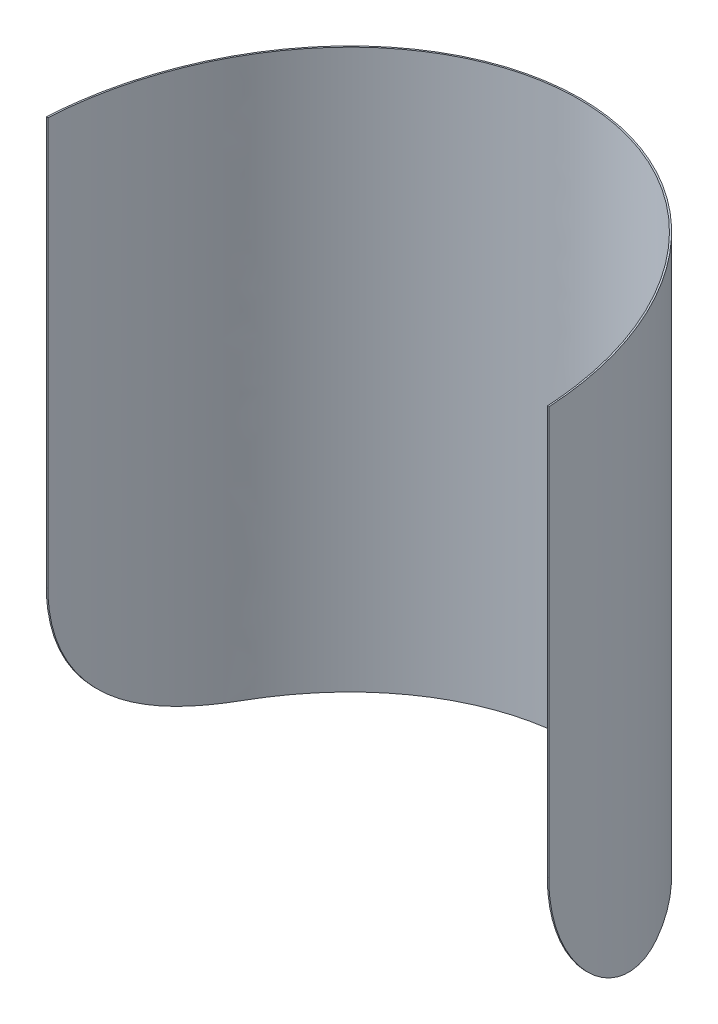
ISO-10303-21;
HEADER;
FILE_DESCRIPTION(('STEP AP214'),'2;1');
FILE_NAME('part.step','',(''),(''),'','','');
FILE_SCHEMA(('AUTOMOTIVE_DESIGN { 1 0 10303 214 1 1 1 1 }'));
ENDSEC;
DATA;
#1=APPLICATION_CONTEXT('core data for automotive mechanical design processes');
#2=APPLICATION_PROTOCOL_DEFINITION('international standard','automotive_design',2000,#1);
#3=PRODUCT_CONTEXT('',#1,'mechanical');
#4=PRODUCT('Part','Part','',(#3));
#5=PRODUCT_RELATED_PRODUCT_CATEGORY('part','',(#4));
#6=PRODUCT_DEFINITION_FORMATION('','',#4);
#7=PRODUCT_DEFINITION_CONTEXT('part definition',#1,'design');
#8=PRODUCT_DEFINITION('design','',#6,#7);
#9=PRODUCT_DEFINITION_SHAPE('','',#8);
#10=(LENGTH_UNIT() NAMED_UNIT(*) SI_UNIT(.MILLI.,.METRE.));
#11=(NAMED_UNIT(*) PLANE_ANGLE_UNIT() SI_UNIT($,.RADIAN.));
#12=(NAMED_UNIT(*) SI_UNIT($,.STERADIAN.) SOLID_ANGLE_UNIT());
#13=UNCERTAINTY_MEASURE_WITH_UNIT(LENGTH_MEASURE(1.E-05),#10,'distance_accuracy_value','');
#14=(GEOMETRIC_REPRESENTATION_CONTEXT(3) GLOBAL_UNCERTAINTY_ASSIGNED_CONTEXT((#13)) GLOBAL_UNIT_ASSIGNED_CONTEXT((#10,
#11,#12)) REPRESENTATION_CONTEXT('',''));
#15=CARTESIAN_POINT('',(0.,0.,0.));
#16=DIRECTION('',(0.,0.,1.));
#17=DIRECTION('',(1.,0.,0.));
#18=AXIS2_PLACEMENT_3D('',#15,#16,#17);
#19=CARTESIAN_POINT('',(-100.,-385.358870368107,-6.6));
#20=DIRECTION('',(0.,0.,-1.));
#21=DIRECTION('',(-1.,0.,0.));
#22=AXIS2_PLACEMENT_3D('',#19,#20,#21);
#23=PLANE('',#22);
#24=DIRECTION('',(1.,0.,0.));
#25=VECTOR('',#24,1.);
#26=CARTESIAN_POINT('',(-83.3199655470095,-135.25,-6.60000000000001));
#27=LINE('',#26,#25);
#28=CARTESIAN_POINT('',(-83.3189655470403,-135.25,-6.59999999999999));
#29=VERTEX_POINT('',#28);
#30=CARTESIAN_POINT('',(-82.8190287071758,-135.25,-6.6));
#31=VERTEX_POINT('',#30);
#32=EDGE_CURVE('E158',#29,#31,#27,.T.);
#33=ORIENTED_EDGE('',*,*,#32,.T.);
#34=DIRECTION('',(0.,1.,0.));
#35=VECTOR('',#34,1.);
#36=CARTESIAN_POINT('',(-82.8190287071758,-185.25,-6.6));
#37=LINE('',#36,#35);
#38=CARTESIAN_POINT('',(-82.8190287071758,0.,-6.6));
#39=VERTEX_POINT('',#38);
#40=EDGE_CURVE('E168',#31,#39,#37,.T.);
#41=ORIENTED_EDGE('',*,*,#40,.T.);
#42=DIRECTION('',(-1.,0.,0.));
#43=VECTOR('',#42,1.);
#44=CARTESIAN_POINT('',(0.,0.,-6.6));
#45=LINE('',#44,#43);
#46=CARTESIAN_POINT('',(-83.3189655470095,0.,-6.6));
#47=VERTEX_POINT('',#46);
#48=EDGE_CURVE('E110',#39,#47,#45,.T.);
#49=ORIENTED_EDGE('',*,*,#48,.T.);
#50=DIRECTION('',(0.,1.,0.));
#51=VECTOR('',#50,1.);
#52=CARTESIAN_POINT('',(-83.3189655470403,-185.25,-6.59999999999999));
#53=LINE('',#52,#51);
#54=EDGE_CURVE('E164',#47,#29,#53,.F.);
#55=ORIENTED_EDGE('',*,*,#54,.T.);
#56=EDGE_LOOP('',(#33,#41,#49,#55));
#57=FACE_BOUND('',#56,.T.);
#58=ADVANCED_FACE('F36',(#57),#23,.F.);
#59=DIRECTION('',(1.,0.,0.));
#60=VECTOR('',#59,1.);
#61=CARTESIAN_POINT('',(-83.3199655470095,-135.25,-6.60000000000001));
#62=LINE('',#61,#60);
#63=CARTESIAN_POINT('',(83.3189655470403,-135.25,-6.60000000000002));
#64=VERTEX_POINT('',#63);
#65=CARTESIAN_POINT('',(82.8190287071757,-135.25,-6.60000000000001));
#66=VERTEX_POINT('',#65);
#67=EDGE_CURVE('E11',#64,#66,#62,.F.);
#68=ORIENTED_EDGE('',*,*,#67,.F.);
#69=DIRECTION('',(0.,1.,0.));
#70=VECTOR('',#69,1.);
#71=CARTESIAN_POINT('',(83.3189655470403,-185.25,-6.60000000000002));
#72=LINE('',#71,#70);
#73=CARTESIAN_POINT('',(83.3189655470095,0.,-6.60000000056195));
#74=VERTEX_POINT('',#73);
#75=EDGE_CURVE('E106',#64,#74,#72,.T.);
#76=ORIENTED_EDGE('',*,*,#75,.T.);
#77=CARTESIAN_POINT('',(82.8190287071757,0.,-6.6));
#78=VERTEX_POINT('',#77);
#79=EDGE_CURVE('E46',#74,#78,#45,.T.);
#80=ORIENTED_EDGE('',*,*,#79,.T.);
#81=DIRECTION('',(0.,1.,0.));
#82=VECTOR('',#81,1.);
#83=CARTESIAN_POINT('',(82.8190287071757,-185.25,-6.6));
#84=LINE('',#83,#82);
#85=EDGE_CURVE('E169',#78,#66,#84,.F.);
#86=ORIENTED_EDGE('',*,*,#85,.T.);
#87=EDGE_LOOP('',(#68,#76,#80,#86));
#88=FACE_BOUND('',#87,.T.);
#89=ADVANCED_FACE('F135',(#88),#23,.F.);
#90=CARTESIAN_POINT('',(0.,-185.25,0.));
#91=DIRECTION('',(0.,-1.,0.));
#92=DIRECTION('',(0.,0.,1.));
#93=AXIS2_PLACEMENT_3D('',#90,#91,#92);
#94=ELLIPSE('',#93,100.,83.);
#95=DIRECTION('',(0.,1.,0.));
#96=VECTOR('',#95,1.);
#97=SURFACE_OF_LINEAR_EXTRUSION('',#94,#96);
#98=CARTESIAN_POINT('',(-68.4256349331156,-185.25,-56.6));
#99=CARTESIAN_POINT('',(-68.7768854216919,-185.250009227083,-55.9836232691039));
#100=CARTESIAN_POINT('',(-69.1217545999552,-185.238602444319,-55.363582897945));
#101=CARTESIAN_POINT('',(-69.7985682322576,-185.192200795737,-54.1169327757958));
#102=CARTESIAN_POINT('',(-70.1305056342758,-185.157193245139,-53.4903196705237));
#103=CARTESIAN_POINT('',(-70.7809961639157,-185.062820603476,-52.2317903809223));
#104=CARTESIAN_POINT('',(-71.0995459299951,-185.003449434686,-51.5998729119282));
#105=CARTESIAN_POINT('',(-71.722886028027,-184.859675828133,-50.3320599066758));
#106=CARTESIAN_POINT('',(-72.0276755823831,-184.775271977796,-49.6961641479086));
#107=CARTESIAN_POINT('',(-72.6236046978122,-184.580704348131,-48.4208671335605));
#108=CARTESIAN_POINT('',(-72.9147256298443,-184.470506571471,-47.7814623486209));
#109=CARTESIAN_POINT('',(-73.4826259240794,-184.223910346305,-46.5014425734839));
#110=CARTESIAN_POINT('',(-73.7594072865977,-184.087515564744,-45.8608277650722));
#111=CARTESIAN_POINT('',(-74.2984793971576,-183.788101872481,-44.5797977107762));
#112=CARTESIAN_POINT('',(-74.5607717269213,-183.62508587565,-43.9393824507279));
#113=CARTESIAN_POINT('',(-75.0707855051028,-183.27210181071,-42.6602001435289));
#114=CARTESIAN_POINT('',(-75.3185070627943,-183.082133944763,-42.0214330840519));
#115=CARTESIAN_POINT('',(-75.8806667504443,-182.60615557447,-40.5315345860122));
#116=CARTESIAN_POINT('',(-76.189339492794,-182.309390133963,-39.6816317216458));
#117=CARTESIAN_POINT('',(-76.7806417910622,-181.666931980979,-37.9912349309126));
#118=CARTESIAN_POINT('',(-77.0632689396481,-181.321234753325,-37.1507418805674));
#119=CARTESIAN_POINT('',(-77.602801528078,-180.581074140397,-35.4830415236626));
#120=CARTESIAN_POINT('',(-77.8597065784688,-180.186610016954,-34.6558344184221));
#121=CARTESIAN_POINT('',(-78.3480134649837,-179.350036294183,-33.0197148414055));
#122=CARTESIAN_POINT('',(-78.5794503791701,-178.907993929941,-32.2107784577222));
#123=CARTESIAN_POINT('',(-79.0180255598844,-177.976689579512,-30.6137666562396));
#124=CARTESIAN_POINT('',(-79.2251642085323,-177.48742833612,-29.8256909105322));
#125=CARTESIAN_POINT('',(-79.6161293305819,-176.462978289869,-28.274130923474));
#126=CARTESIAN_POINT('',(-79.7999572942521,-175.927792426674,-27.5106451124017));
#127=CARTESIAN_POINT('',(-80.2174970669045,-174.580658256523,-25.6993678088911));
#128=CARTESIAN_POINT('',(-80.4401038200078,-173.746266216619,-24.6655814879895));
#129=CARTESIAN_POINT('',(-80.8448379570182,-171.993533458373,-22.6635406915674));
#130=CARTESIAN_POINT('',(-81.0269666307765,-171.075195416323,-21.6952841285972));
#131=CARTESIAN_POINT('',(-81.3552428357818,-169.160164320723,-19.8319902159136));
#132=CARTESIAN_POINT('',(-81.5013716689161,-168.163430902125,-18.9369910761551));
#133=CARTESIAN_POINT('',(-81.7621577830227,-166.098760174588,-17.2280623795057));
#134=CARTESIAN_POINT('',(-81.8768147314995,-165.03082211353,-16.4141336791693));
#135=CARTESIAN_POINT('',(-82.0458472877933,-163.194804694105,-15.1283619922823));
#136=CARTESIAN_POINT('',(-82.1076248704363,-162.444194577532,-14.6323273996913));
#137=CARTESIAN_POINT('',(-82.2205305349098,-160.916680693277,-13.681113796215));
#138=CARTESIAN_POINT('',(-82.2716585476978,-160.139776755165,-13.2259350502144));
#139=CARTESIAN_POINT('',(-82.3645765888824,-158.562094273178,-12.3579726529288));
#140=CARTESIAN_POINT('',(-82.4063664236623,-157.76131523467,-11.9451898807726));
#141=CARTESIAN_POINT('',(-82.4818468234484,-156.138413661754,-11.1633924828316));
#142=CARTESIAN_POINT('',(-82.5155383525234,-155.316293680818,-10.7943726499079));
#143=CARTESIAN_POINT('',(-82.57597726169,-153.653124727272,-10.1012187482144));
#144=CARTESIAN_POINT('',(-82.6027248066798,-152.812076204673,-9.77708361365731));
#145=CARTESIAN_POINT('',(-82.6503156210767,-151.113605625705,-9.17471325128794));
#146=CARTESIAN_POINT('',(-82.6711593926007,-150.256184968415,-8.896474120854));
#147=CARTESIAN_POINT('',(-82.7057300538854,-148.627744023453,-8.41628231231862));
#148=CARTESIAN_POINT('',(-82.7200019603415,-147.858235402592,-8.20922474042236));
#149=CARTESIAN_POINT('',(-82.7451879306554,-146.310203637507,-7.83211638959701));
#150=CARTESIAN_POINT('',(-82.7561022569452,-145.531681202751,-7.66206271870674));
#151=CARTESIAN_POINT('',(-82.775026724812,-143.967394088054,-7.35934929952031));
#152=CARTESIAN_POINT('',(-82.7830369600977,-143.181629642636,-7.22668834467182));
#153=CARTESIAN_POINT('',(-82.796506094786,-141.604961565383,-6.99910637061853));
#154=CARTESIAN_POINT('',(-82.8019660402586,-140.814060175812,-6.90416988009805));
#155=CARTESIAN_POINT('',(-82.8106027937788,-139.228579743979,-6.75218128506744));
#156=CARTESIAN_POINT('',(-82.8137795048411,-138.434000546936,-6.69513078985418));
#157=CARTESIAN_POINT('',(-82.8179832630385,-136.842948029344,-6.61903056231784));
#158=CARTESIAN_POINT('',(-82.8190101187348,-136.046474546435,-6.59998421416804));
#159=CARTESIAN_POINT('',(-82.8190287071758,-135.25,-6.60000000000001));
#160=B_SPLINE_CURVE_WITH_KNOTS('',3,(#98,#99,#100,#101,#102,#103,#104,#105,#106,#107,#108,#109,
#110,#111,#112,#113,#114,#115,#116,#117,#118,#119,#120,#121,#122,#123,#124,#125,#126,#127,#128,
#129,#130,#131,#132,#133,#134,#135,#136,#137,#138,#139,#140,#141,#142,#143,#144,#145,#146,#147,
#148,#149,#150,#151,#152,#153,#154,#155,#156,#157,#158,#159),.UNSPECIFIED.,.F.,.F.,(4,2,2,2,2,2,
2,2,2,2,2,2,2,2,2,2,2,2,2,2,2,2,2,2,2,2,2,2,2,2,4),(0.,2.12820839314464,4.25756155413929,
6.38744622488535,8.51745110620344,10.6502793789544,12.782809324768,14.9151060070412,
17.0473866960945,19.9006932429295,22.7542632502007,25.607876456283,28.457508754264,
31.307096232278,34.1565014422087,38.1924804117551,42.2283307546623,46.2662728967004,
50.3042576973229,53.0084705482084,55.7127009303067,58.4169873763913,61.1209517290926,
63.8248518651448,66.5285219649421,68.9186466695435,71.3085845118898,73.698445229181,
76.0873248180325,78.4763058736808,80.8654996525646),.UNSPECIFIED.);
#161=CARTESIAN_POINT('',(-68.4256349331156,-185.25,-56.6));
#162=VERTEX_POINT('',#161);
#163=EDGE_CURVE('E53',#162,#31,#160,.T.);
#164=ORIENTED_EDGE('',*,*,#163,.F.);
#165=CARTESIAN_POINT('',(68.4256349331155,-185.25,-56.6));
#166=VERTEX_POINT('',#165);
#167=EDGE_CURVE('E111',#162,#166,#94,.T.);
#168=ORIENTED_EDGE('',*,*,#167,.T.);
#169=CARTESIAN_POINT('',(82.8190287071757,-135.25,-6.6));
#170=CARTESIAN_POINT('',(82.8189938383726,-136.182579463709,-6.59997029125117));
#171=CARTESIAN_POINT('',(82.8175951294704,-137.115156734692,-6.62608999415294));
#172=CARTESIAN_POINT('',(82.8118191097757,-138.977362855764,-6.73041384977405));
#173=CARTESIAN_POINT('',(82.8074418679995,-139.906991773668,-6.80861679565888));
#174=CARTESIAN_POINT('',(82.795457931547,-141.760393056435,-7.01689192990505));
#175=CARTESIAN_POINT('',(82.7878512633009,-142.684165469165,-7.14696369376351));
#176=CARTESIAN_POINT('',(82.7689186452344,-144.522667012148,-7.45850426432962));
#177=CARTESIAN_POINT('',(82.7575938597618,-145.437398881236,-7.63995697838318));
#178=CARTESIAN_POINT('',(82.7305638173982,-147.255214010168,-8.05369485365341));
#179=CARTESIAN_POINT('',(82.7148586298198,-148.158297454092,-8.28597921053067));
#180=CARTESIAN_POINT('',(82.6782309790595,-149.949968505322,-8.80063123986303));
#181=CARTESIAN_POINT('',(82.6573085391342,-150.838556177226,-9.08299868906263));
#182=CARTESIAN_POINT('',(82.6092346313272,-152.599007248324,-9.6971044884104));
#183=CARTESIAN_POINT('',(82.5820789755263,-153.470858974414,-10.0288759788361));
#184=CARTESIAN_POINT('',(82.520403461688,-155.194438874739,-10.740555267718));
#185=CARTESIAN_POINT('',(82.4858835069341,-156.046166784522,-11.1204636983368));
#186=CARTESIAN_POINT('',(82.4082095228862,-157.726744108006,-11.9271365394427));
#187=CARTESIAN_POINT('',(82.3650554396986,-158.555593378865,-12.3539012423953));
#188=CARTESIAN_POINT('',(82.2687462962352,-160.187553662371,-13.2527270701272));
#189=CARTESIAN_POINT('',(82.2155931205669,-160.990669491874,-13.7247796509423));
#190=CARTESIAN_POINT('',(82.0978193243822,-162.56870176062,-14.7125922498123));
#191=CARTESIAN_POINT('',(82.0331987597583,-163.343618337286,-15.2283520548299));
#192=CARTESIAN_POINT('',(81.8909786907273,-164.862642442493,-16.3016567194369));
#193=CARTESIAN_POINT('',(81.8133793315694,-165.606750315706,-16.8592011113646));
#194=CARTESIAN_POINT('',(81.6024145107059,-167.415161337367,-18.2945724257203));
#195=CARTESIAN_POINT('',(81.4602670308969,-168.459495440983,-19.19646110309));
#196=CARTESIAN_POINT('',(81.1387844548778,-170.467170910392,-21.0803510069096));
#197=CARTESIAN_POINT('',(80.9594495015556,-171.430512587367,-22.0623519255304));
#198=CARTESIAN_POINT('',(80.6590502016508,-172.809166710907,-23.5881943765757));
#199=CARTESIAN_POINT('',(80.5536987363724,-173.257608790153,-24.1055504745132));
#200=CARTESIAN_POINT('',(80.3319495258846,-174.13177274081,-25.1568001486906));
#201=CARTESIAN_POINT('',(80.2155528348115,-174.557496774343,-25.6906921435052));
#202=CARTESIAN_POINT('',(79.9711747811301,-175.385544563356,-26.7737895576988));
#203=CARTESIAN_POINT('',(79.8431928050157,-175.78786707774,-27.3229957869859));
#204=CARTESIAN_POINT('',(79.575176440381,-176.568431670084,-28.435326353597));
#205=CARTESIAN_POINT('',(79.435142916141,-176.946675471476,-28.9984496907905));
#206=CARTESIAN_POINT('',(79.0991815828628,-177.78711127818,-30.3061944793207));
#207=CARTESIAN_POINT('',(78.8989925208274,-178.24093783526,-31.055120525226));
#208=CARTESIAN_POINT('',(78.4767846288335,-179.106245522915,-32.571028073548));
#209=CARTESIAN_POINT('',(78.2547658859764,-179.517726822436,-33.3380095039136));
#210=CARTESIAN_POINT('',(77.788247619092,-180.29766358959,-34.8868747591911));
#211=CARTESIAN_POINT('',(77.5437479720283,-180.666118821721,-35.6687586656446));
#212=CARTESIAN_POINT('',(77.0315874801619,-181.359877326009,-37.2448660975503));
#213=CARTESIAN_POINT('',(76.7639069455657,-181.685143307397,-38.0390996335811));
#214=CARTESIAN_POINT('',(76.2052960712075,-182.292024368469,-39.6359918753726));
#215=CARTESIAN_POINT('',(75.9143659939315,-182.573639940858,-40.4386504859259));
#216=CARTESIAN_POINT('',(75.3091813434049,-183.093374517334,-42.04914739274));
#217=CARTESIAN_POINT('',(74.9949294791433,-183.331498562181,-42.8569850774869));
#218=CARTESIAN_POINT('',(74.4495868687583,-183.694014054674,-44.2106595887411));
#219=CARTESIAN_POINT('',(74.2248342083543,-183.830157976975,-44.7559436242086));
#220=CARTESIAN_POINT('',(73.764861955969,-184.083149473794,-45.8465447537277));
#221=CARTESIAN_POINT('',(73.5296430306387,-184.199998275092,-46.3918618434708));
#222=CARTESIAN_POINT('',(73.0488255497105,-184.414668089693,-47.4816732928218));
#223=CARTESIAN_POINT('',(72.8032267329822,-184.512488623947,-48.0261676313742));
#224=CARTESIAN_POINT('',(72.3017663642884,-184.689416346468,-49.1135099804492));
#225=CARTESIAN_POINT('',(72.0459041399507,-184.768522306365,-49.6563578805969));
#226=CARTESIAN_POINT('',(71.5246074502643,-184.908228155021,-50.7384803050845));
#227=CARTESIAN_POINT('',(71.2591930569341,-184.968864574803,-51.2777597920462));
#228=CARTESIAN_POINT('',(70.7184948663692,-185.072236511278,-52.3530607985007));
#229=CARTESIAN_POINT('',(70.4432112524356,-185.114972360252,-52.8890823782864));
#230=CARTESIAN_POINT('',(69.8830012694189,-185.182967721967,-53.9570876462278));
#231=CARTESIAN_POINT('',(69.5980761228666,-185.208229441755,-54.489071835923));
#232=CARTESIAN_POINT('',(69.0188503397761,-185.241745445424,-55.5482520812126));
#233=CARTESIAN_POINT('',(68.7245524689809,-185.2500047001,-56.075449491369));
#234=CARTESIAN_POINT('',(68.4256349331156,-185.25,-56.5999999999999));
#235=B_SPLINE_CURVE_WITH_KNOTS('',3,(#169,#170,#171,#172,#173,#174,#175,#176,#177,#178,#179,
#180,#181,#182,#183,#184,#185,#186,#187,#188,#189,#190,#191,#192,#193,#194,#195,#196,#197,#198,
#199,#200,#201,#202,#203,#204,#205,#206,#207,#208,#209,#210,#211,#212,#213,#214,#215,#216,#217,
#218,#219,#220,#221,#222,#223,#224,#225,#226,#227,#228,#229,#230,#231,#232,#233,#234),
.UNSPECIFIED.,.F.,.F.,(4,2,2,2,2,2,2,2,2,2,2,2,2,2,2,2,2,2,2,2,2,2,2,2,2,2,2,2,2,2,2,2,4),(0.,
2.79736863931814,5.59467246232739,8.39195339221513,11.1883591732871,13.9847207083619,
16.7810697784033,19.5793031632203,22.377573299891,25.1758609036871,27.9736216197138,
30.7713686997031,33.569084471403,37.7252998202464,41.8814991996997,43.959103026891,
46.0365087704005,48.114024588679,50.1913915412857,52.8847544366903,55.5781065858789,
58.2714734764623,60.967150977128,63.6627980480745,66.3581324893609,68.1736559371932,
69.9890639099378,71.8045175807157,73.6200903796094,75.4320484711003,77.2439729265205,
79.0556684874577,80.8668343106502),.UNSPECIFIED.);
#236=EDGE_CURVE('E91',#66,#166,#235,.T.);
#237=ORIENTED_EDGE('',*,*,#236,.F.);
#238=ORIENTED_EDGE('',*,*,#85,.F.);
#239=CARTESIAN_POINT('',(0.,0.,0.));
#240=DIRECTION('',(0.,-1.,0.));
#241=DIRECTION('',(0.,0.,1.));
#242=AXIS2_PLACEMENT_3D('',#239,#240,#241);
#243=ELLIPSE('',#242,100.,83.);
#244=EDGE_CURVE('E120',#39,#78,#243,.T.);
#245=ORIENTED_EDGE('',*,*,#244,.F.);
#246=ORIENTED_EDGE('',*,*,#40,.F.);
#247=EDGE_LOOP('',(#164,#168,#237,#238,#245,#246));
#248=FACE_BOUND('',#247,.T.);
#249=ADVANCED_FACE('F38',(#248),#97,.T.);
#250=CARTESIAN_POINT('',(83.5,-185.25,0.));
#251=CARTESIAN_POINT('',(83.5,-185.25,-6.5519432380964));
#252=CARTESIAN_POINT('',(82.4255292073359,-185.25,-19.7256245338788));
#253=CARTESIAN_POINT('',(77.6516490303719,-185.25,-38.6752690979979));
#254=CARTESIAN_POINT('',(69.8969004414113,-185.25,-56.1587176982592));
#255=CARTESIAN_POINT('',(59.456164576806,-185.25,-71.4869891133584));
#256=CARTESIAN_POINT('',(46.7260619809048,-185.25,-84.0734028301062));
#257=CARTESIAN_POINT('',(27.3510641739143,-185.25,-96.5595636040295));
#258=CARTESIAN_POINT('',(0.,-185.25,-103.126957597314));
#259=CARTESIAN_POINT('',(-27.3510641739143,-185.25,-96.5595636040295));
#260=CARTESIAN_POINT('',(-46.7260619809048,-185.25,-84.0734028301062));
#261=CARTESIAN_POINT('',(-59.456164576806,-185.25,-71.4869891133584));
#262=CARTESIAN_POINT('',(-69.8969004414113,-185.25,-56.1587176982592));
#263=CARTESIAN_POINT('',(-77.6516490303719,-185.25,-38.675269097998));
#264=CARTESIAN_POINT('',(-82.4255292073359,-185.25,-19.7256245338788));
#265=CARTESIAN_POINT('',(-83.5,-185.25,-6.55194323809643));
#266=CARTESIAN_POINT('',(-83.5,-185.25,0.));
#267=B_SPLINE_CURVE_WITH_KNOTS('',3,(#250,#251,#252,#253,#254,#255,#256,#257,#258,#259,#260,
#261,#262,#263,#264,#265,#266),.UNSPECIFIED.,.F.,.F.,(4,1,1,1,1,1,1,1,1,1,1,1,1,1,4),
(1.5707963267949,1.76714586764426,1.96349540849362,2.15984494934298,2.35619449019234,
2.55254403104171,2.74889357189107,3.14159265358979,3.53429173528852,3.73064127613788,
3.92699081698724,4.1233403578366,4.31968989868597,4.51603943953533,4.71238898038469),.UNSPECIFIED.);
#268=DIRECTION('',(0.,1.,0.));
#269=VECTOR('',#268,1.);
#270=SURFACE_OF_LINEAR_EXTRUSION('',#267,#269);
#271=CARTESIAN_POINT('',(69.0006883099171,-185.25,-56.6));
#272=CARTESIAN_POINT('',(69.3502812827166,-185.250009602594,-55.9825849151867));
#273=CARTESIAN_POINT('',(69.6934947363422,-185.238564031786,-55.361531330774));
#274=CARTESIAN_POINT('',(70.3670233689338,-185.192013371393,-54.1129217680701));
#275=CARTESIAN_POINT('',(70.6973315624336,-185.156895651035,-53.4853624946339));
#276=CARTESIAN_POINT('',(71.3446170883281,-185.062238127438,-52.2250207913141));
#277=CARTESIAN_POINT('',(71.6615910758855,-185.002692236283,-51.5922370979643));
#278=CARTESIAN_POINT('',(72.2818519038682,-184.8585131878,-50.3227792213991));
#279=CARTESIAN_POINT('',(72.5851379576826,-184.773878590797,-49.6861048169755));
#280=CARTESIAN_POINT('',(73.1781427717037,-184.578801613242,-48.4093390094115));
#281=CARTESIAN_POINT('',(73.4678429665404,-184.468325085837,-47.769244189749));
#282=CARTESIAN_POINT('',(74.0329910063191,-184.221132176329,-46.4879344108603));
#283=CARTESIAN_POINT('',(74.3084408184448,-184.084419428322,-45.8467196189412));
#284=CARTESIAN_POINT('',(74.8449370770198,-183.784338145301,-44.5645759733892));
#285=CARTESIAN_POINT('',(75.1059850893788,-183.620972515932,-43.9236470962153));
#286=CARTESIAN_POINT('',(75.6135890468647,-183.267263743686,-42.6435177043703));
#287=CARTESIAN_POINT('',(75.8601451083814,-183.076920817514,-42.0043171758576));
#288=CARTESIAN_POINT('',(76.4196525299073,-182.600045831103,-40.513503257211));
#289=CARTESIAN_POINT('',(76.7268653471831,-182.302751465028,-39.6631467571867));
#290=CARTESIAN_POINT('',(77.3153178642529,-181.659206888201,-37.9719500262864));
#291=CARTESIAN_POINT('',(77.5965551976567,-181.312952224378,-37.1311106685414));
#292=CARTESIAN_POINT('',(78.1333956289514,-180.571660343035,-35.4628234557515));
#293=CARTESIAN_POINT('',(78.3889983397611,-180.17662238909,-34.6353758030788));
#294=CARTESIAN_POINT('',(78.8748072676395,-179.338897068574,-32.998877223887));
#295=CARTESIAN_POINT('',(79.1050484101104,-178.896276931224,-32.1898022476215));
#296=CARTESIAN_POINT('',(79.5413403495176,-177.963820687264,-30.5926061862542));
#297=CARTESIAN_POINT('',(79.7473915067573,-177.473985284111,-29.8044847891897));
#298=CARTESIAN_POINT('',(80.1362861568883,-176.44839688837,-28.2529168622013));
#299=CARTESIAN_POINT('',(80.3191311151584,-175.912646798692,-27.4894687765276));
#300=CARTESIAN_POINT('',(80.7344615069568,-174.563993888578,-25.6781400604626));
#301=CARTESIAN_POINT('',(80.9558792200671,-173.728635022389,-24.6443140591689));
#302=CARTESIAN_POINT('',(81.3583705665521,-171.97397120931,-22.6423487781005));
#303=CARTESIAN_POINT('',(81.5394455241873,-171.054669019277,-21.6742073429403));
#304=CARTESIAN_POINT('',(81.865696071587,-169.137717510834,-19.811280455709));
#305=CARTESIAN_POINT('',(82.0108529490135,-168.140027709709,-18.9165334016823));
#306=CARTESIAN_POINT('',(82.2698307143882,-166.073468689232,-17.2082411584007));
#307=CARTESIAN_POINT('',(82.383651247106,-165.004598663147,-16.3946968897311));
#308=CARTESIAN_POINT('',(82.5514418415931,-163.167092577912,-15.1096960288548));
#309=CARTESIAN_POINT('',(82.6127623075346,-162.415916886902,-14.6140116892929));
#310=CARTESIAN_POINT('',(82.7248355751405,-160.887292914145,-13.6635470204114));
#311=CARTESIAN_POINT('',(82.7755883119816,-160.109844471273,-13.2087669420109));
#312=CARTESIAN_POINT('',(82.8678315104543,-158.531095022295,-12.3416469512597));
#313=CARTESIAN_POINT('',(82.9093217771424,-157.729793514566,-11.9293079322469));
#314=CARTESIAN_POINT('',(82.9842681169384,-156.105875599218,-11.1484429697595));
#315=CARTESIAN_POINT('',(83.0177251949325,-155.283261871861,-10.779911549228));
#316=CARTESIAN_POINT('',(83.0777492665446,-153.619131212607,-10.0877744681525));
#317=CARTESIAN_POINT('',(83.1043164261194,-152.77761473655,-9.76416772559921));
#318=CARTESIAN_POINT('',(83.1515894232849,-151.078236667715,-9.16289248195904));
#319=CARTESIAN_POINT('',(83.1722957693916,-150.220376499903,-8.88521999623603));
#320=CARTESIAN_POINT('',(83.2065919482044,-148.59334714418,-8.40678007887844));
#321=CARTESIAN_POINT('',(83.2207343843459,-147.825717491539,-8.20079824210056));
#322=CARTESIAN_POINT('',(83.2456990264204,-146.281515946281,-7.82565325101043));
#323=CARTESIAN_POINT('',(83.2565214970975,-145.504944771816,-7.65648716121119));
#324=CARTESIAN_POINT('',(83.2752913254856,-143.944618131697,-7.35535639532448));
#325=CARTESIAN_POINT('',(83.2832387785723,-143.160862905252,-7.22339048519131));
#326=CARTESIAN_POINT('',(83.2966048386667,-141.588264817397,-6.99700374051851));
#327=CARTESIAN_POINT('',(83.3020245124163,-140.799424244788,-6.90256707084987));
#328=CARTESIAN_POINT('',(83.3105985860141,-139.218093774938,-6.7513790106958));
#329=CARTESIAN_POINT('',(83.313752887941,-138.425603721438,-6.69462924924542));
#330=CARTESIAN_POINT('',(83.3179273355032,-136.838742906021,-6.6189302230514));
#331=CARTESIAN_POINT('',(83.3189472878683,-136.044371980307,-6.59998438154802));
#332=CARTESIAN_POINT('',(83.3189655470403,-135.25,-6.60000000000002));
#333=B_SPLINE_CURVE_WITH_KNOTS('',3,(#271,#272,#273,#274,#275,#276,#277,#278,#279,#280,#281,
#282,#283,#284,#285,#286,#287,#288,#289,#290,#291,#292,#293,#294,#295,#296,#297,#298,#299,#300,
#301,#302,#303,#304,#305,#306,#307,#308,#309,#310,#311,#312,#313,#314,#315,#316,#317,#318,#319,
#320,#321,#322,#323,#324,#325,#326,#327,#328,#329,#330,#331,#332),.UNSPECIFIED.,.F.,.F.,(4,2,2,
2,2,2,2,2,2,2,2,2,2,2,2,2,2,2,2,2,2,2,2,2,2,2,2,2,2,2,4),(0.,2.12845939279378,4.25805536974671,
6.38818240090616,8.51843168962857,10.6515118959668,12.7842968527529,14.9168494526135,
17.0493849228959,19.9029853200166,22.7568454268505,25.6107486203242,28.4606712313347,
31.3105513881314,34.1602514967434,38.1975301062215,42.2346761715472,46.2739210722424,
50.3132117601358,53.0181658195089,55.7231364707635,58.4281640470531,61.1328530700359,
63.8374769393813,66.5418660688997,68.9257112654843,71.3093663175511,73.6929422870555,
76.0755114573319,78.4581836086239,80.8410715070959),.UNSPECIFIED.);
#334=CARTESIAN_POINT('',(69.0006883099171,-185.25,-56.6));
#335=VERTEX_POINT('',#334);
#336=EDGE_CURVE('E60',#335,#64,#333,.T.);
#337=ORIENTED_EDGE('',*,*,#336,.F.);
#338=CARTESIAN_POINT('',(-69.0006883098816,-185.25,-56.6));
#339=VERTEX_POINT('',#338);
#340=EDGE_CURVE('E104',#335,#339,#267,.T.);
#341=ORIENTED_EDGE('',*,*,#340,.T.);
#342=CARTESIAN_POINT('',(-69.0006883099171,-185.25,-56.6));
#343=CARTESIAN_POINT('',(-69.3502812827166,-185.250009602594,-55.9825849151867));
#344=CARTESIAN_POINT('',(-69.6934947363422,-185.238564031786,-55.361531330774));
#345=CARTESIAN_POINT('',(-70.3670233689338,-185.192013371393,-54.1129217680701));
#346=CARTESIAN_POINT('',(-70.6973315624337,-185.156895651035,-53.4853624946339));
#347=CARTESIAN_POINT('',(-71.3446170883281,-185.062238127438,-52.2250207913141));
#348=CARTESIAN_POINT('',(-71.6615910758855,-185.002692236283,-51.5922370979643));
#349=CARTESIAN_POINT('',(-72.2818519038682,-184.8585131878,-50.3227792213991));
#350=CARTESIAN_POINT('',(-72.5851379576825,-184.773878590797,-49.6861048169755));
#351=CARTESIAN_POINT('',(-73.1781427717037,-184.578801613242,-48.4093390094115));
#352=CARTESIAN_POINT('',(-73.4678429665404,-184.468325085837,-47.769244189749));
#353=CARTESIAN_POINT('',(-74.0329910063191,-184.221132176329,-46.4879344108603));
#354=CARTESIAN_POINT('',(-74.3084408184448,-184.084419428322,-45.8467196189412));
#355=CARTESIAN_POINT('',(-74.8449370770198,-183.784338145301,-44.5645759733892));
#356=CARTESIAN_POINT('',(-75.1059850893787,-183.620972515932,-43.9236470962153));
#357=CARTESIAN_POINT('',(-75.6135890468647,-183.267263743686,-42.6435177043703));
#358=CARTESIAN_POINT('',(-75.8601451083814,-183.076920817514,-42.0043171758576));
#359=CARTESIAN_POINT('',(-76.4196525299073,-182.600045831103,-40.5135032572111));
#360=CARTESIAN_POINT('',(-76.7268653471831,-182.302751465028,-39.6631467571868));
#361=CARTESIAN_POINT('',(-77.3153178642529,-181.659206888201,-37.9719500262864));
#362=CARTESIAN_POINT('',(-77.5965551976567,-181.312952224378,-37.1311106685414));
#363=CARTESIAN_POINT('',(-78.1333956289515,-180.571660343035,-35.4628234557515));
#364=CARTESIAN_POINT('',(-78.3889983397611,-180.17662238909,-34.6353758030788));
#365=CARTESIAN_POINT('',(-78.8748072676396,-179.338897068574,-32.998877223887));
#366=CARTESIAN_POINT('',(-79.1050484101104,-178.896276931224,-32.1898022476215));
#367=CARTESIAN_POINT('',(-79.5413403495176,-177.963820687264,-30.5926061862542));
#368=CARTESIAN_POINT('',(-79.7473915067573,-177.473985284111,-29.8044847891898));
#369=CARTESIAN_POINT('',(-80.1362861568883,-176.44839688837,-28.2529168622013));
#370=CARTESIAN_POINT('',(-80.3191311151584,-175.912646798693,-27.4894687765276));
#371=CARTESIAN_POINT('',(-80.7344615069568,-174.563993888578,-25.6781400604626));
#372=CARTESIAN_POINT('',(-80.9558792200671,-173.728635022389,-24.6443140591689));
#373=CARTESIAN_POINT('',(-81.3583705665521,-171.97397120931,-22.6423487781005));
#374=CARTESIAN_POINT('',(-81.5394455241873,-171.054669019277,-21.6742073429403));
#375=CARTESIAN_POINT('',(-81.865696071587,-169.137717510834,-19.8112804557089));
#376=CARTESIAN_POINT('',(-82.0108529490135,-168.140027709709,-18.9165334016823));
#377=CARTESIAN_POINT('',(-82.2698307143882,-166.073468689232,-17.2082411584007));
#378=CARTESIAN_POINT('',(-82.383651247106,-165.004598663147,-16.3946968897312));
#379=CARTESIAN_POINT('',(-82.5514418415931,-163.167092577912,-15.1096960288548));
#380=CARTESIAN_POINT('',(-82.6127623075346,-162.415916886902,-14.6140116892929));
#381=CARTESIAN_POINT('',(-82.7248355751405,-160.887292914145,-13.6635470204113));
#382=CARTESIAN_POINT('',(-82.7755883119816,-160.109844471273,-13.2087669420109));
#383=CARTESIAN_POINT('',(-82.8678315104543,-158.531095022295,-12.3416469512597));
#384=CARTESIAN_POINT('',(-82.9093217771424,-157.729793514566,-11.9293079322469));
#385=CARTESIAN_POINT('',(-82.9842681169384,-156.105875599218,-11.1484429697595));
#386=CARTESIAN_POINT('',(-83.0177251949325,-155.283261871861,-10.779911549228));
#387=CARTESIAN_POINT('',(-83.0777492665446,-153.619131212607,-10.0877744681525));
#388=CARTESIAN_POINT('',(-83.1043164261194,-152.77761473655,-9.76416772559921));
#389=CARTESIAN_POINT('',(-83.1515894232849,-151.078236667715,-9.16289248195904));
#390=CARTESIAN_POINT('',(-83.1722957693916,-150.220376499903,-8.88521999623604));
#391=CARTESIAN_POINT('',(-83.2065919482044,-148.59334714418,-8.40678007887845));
#392=CARTESIAN_POINT('',(-83.2207343843459,-147.825717491539,-8.20079824210054));
#393=CARTESIAN_POINT('',(-83.2456990264204,-146.281515946281,-7.8256532510104));
#394=CARTESIAN_POINT('',(-83.2565214970975,-145.504944771816,-7.65648716121117));
#395=CARTESIAN_POINT('',(-83.2752913254856,-143.944618131697,-7.35535639532448));
#396=CARTESIAN_POINT('',(-83.2832387785724,-143.160862905252,-7.2233904851913));
#397=CARTESIAN_POINT('',(-83.2966048386667,-141.588264817397,-6.99700374051851));
#398=CARTESIAN_POINT('',(-83.3020245124163,-140.799424244788,-6.90256707084987));
#399=CARTESIAN_POINT('',(-83.3105985860141,-139.218093774938,-6.7513790106958));
#400=CARTESIAN_POINT('',(-83.313752887941,-138.425603721438,-6.69462924924542));
#401=CARTESIAN_POINT('',(-83.3179273355032,-136.838742906021,-6.6189302230514));
#402=CARTESIAN_POINT('',(-83.3189472878683,-136.044371980307,-6.59998438154801));
#403=CARTESIAN_POINT('',(-83.3189655470403,-135.25,-6.59999999999998));
#404=B_SPLINE_CURVE_WITH_KNOTS('',3,(#342,#343,#344,#345,#346,#347,#348,#349,#350,#351,#352,
#353,#354,#355,#356,#357,#358,#359,#360,#361,#362,#363,#364,#365,#366,#367,#368,#369,#370,#371,
#372,#373,#374,#375,#376,#377,#378,#379,#380,#381,#382,#383,#384,#385,#386,#387,#388,#389,#390,
#391,#392,#393,#394,#395,#396,#397,#398,#399,#400,#401,#402,#403),.UNSPECIFIED.,.F.,.F.,(4,2,2,
2,2,2,2,2,2,2,2,2,2,2,2,2,2,2,2,2,2,2,2,2,2,2,2,2,2,2,4),(0.,2.12845939279378,4.25805536974671,
6.38818240090615,8.51843168962854,10.6515118959668,12.7842968527529,14.9168494526135,
17.0493849228959,19.9029853200166,22.7568454268505,25.6107486203242,28.4606712313347,
31.3105513881313,34.1602514967434,38.1975301062215,42.2346761715471,46.2739210722424,
50.3132117601358,53.0181658195089,55.7231364707635,58.4281640470531,61.1328530700359,
63.8374769393813,66.5418660688997,68.9257112654843,71.3093663175511,73.6929422870556,
76.075511457332,78.4581836086239,80.841071507096),.UNSPECIFIED.);
#405=EDGE_CURVE('E97',#339,#29,#404,.T.);
#406=ORIENTED_EDGE('',*,*,#405,.T.);
#407=ORIENTED_EDGE('',*,*,#54,.F.);
#408=CARTESIAN_POINT('',(83.5,0.,0.));
#409=CARTESIAN_POINT('',(83.5,0.,-6.5519432380964));
#410=CARTESIAN_POINT('',(82.4255292073359,0.,-19.7256245338788));
#411=CARTESIAN_POINT('',(77.6516490303719,0.,-38.6752690979979));
#412=CARTESIAN_POINT('',(69.8969004414113,0.,-56.1587176982592));
#413=CARTESIAN_POINT('',(59.456164576806,0.,-71.4869891133584));
#414=CARTESIAN_POINT('',(46.7260619809048,0.,-84.0734028301062));
#415=CARTESIAN_POINT('',(27.3510641739143,0.,-96.5595636040295));
#416=CARTESIAN_POINT('',(0.,0.,-103.126957597314));
#417=CARTESIAN_POINT('',(-27.3510641739143,0.,-96.5595636040295));
#418=CARTESIAN_POINT('',(-46.7260619809048,0.,-84.0734028301062));
#419=CARTESIAN_POINT('',(-59.456164576806,0.,-71.4869891133584));
#420=CARTESIAN_POINT('',(-69.8969004414113,0.,-56.1587176982592));
#421=CARTESIAN_POINT('',(-77.6516490303719,0.,-38.675269097998));
#422=CARTESIAN_POINT('',(-82.4255292073359,0.,-19.7256245338788));
#423=CARTESIAN_POINT('',(-83.5,0.,-6.55194323809643));
#424=CARTESIAN_POINT('',(-83.5,0.,0.));
#425=B_SPLINE_CURVE_WITH_KNOTS('',3,(#408,#409,#410,#411,#412,#413,#414,#415,#416,#417,#418,
#419,#420,#421,#422,#423,#424),.UNSPECIFIED.,.F.,.F.,(4,1,1,1,1,1,1,1,1,1,1,1,1,1,4),
(1.5707963267949,1.76714586764426,1.96349540849362,2.15984494934298,2.35619449019234,
2.55254403104171,2.74889357189107,3.14159265358979,3.53429173528852,3.73064127613788,
3.92699081698724,4.1233403578366,4.31968989868597,4.51603943953533,4.71238898038469),.UNSPECIFIED.);
#426=EDGE_CURVE('E113',#74,#47,#425,.T.);
#427=ORIENTED_EDGE('',*,*,#426,.F.);
#428=ORIENTED_EDGE('',*,*,#75,.F.);
#429=EDGE_LOOP('',(#337,#341,#406,#407,#427,#428));
#430=FACE_BOUND('',#429,.T.);
#431=ADVANCED_FACE('F102',(#430),#270,.T.);
#432=CARTESIAN_POINT('',(0.,-185.25,0.));
#433=DIRECTION('',(0.,1.,0.));
#434=DIRECTION('',(0.,0.,1.));
#435=AXIS2_PLACEMENT_3D('',#432,#433,#434);
#436=PLANE('',#435);
#437=ORIENTED_EDGE('',*,*,#340,.F.);
#438=DIRECTION('',(1.,0.,0.));
#439=VECTOR('',#438,1.);
#440=CARTESIAN_POINT('',(-83.3199655470095,-185.25,-56.6));
#441=LINE('',#440,#439);
#442=EDGE_CURVE('E88',#166,#335,#441,.T.);
#443=ORIENTED_EDGE('',*,*,#442,.F.);
#444=ORIENTED_EDGE('',*,*,#167,.F.);
#445=EDGE_CURVE('E96',#339,#162,#441,.T.);
#446=ORIENTED_EDGE('',*,*,#445,.F.);
#447=EDGE_LOOP('',(#437,#443,#444,#446));
#448=FACE_BOUND('',#447,.T.);
#449=ADVANCED_FACE('F109',(#448),#436,.F.);
#450=CARTESIAN_POINT('',(0.,0.,0.));
#451=DIRECTION('',(0.,1.,0.));
#452=DIRECTION('',(0.,0.,1.));
#453=AXIS2_PLACEMENT_3D('',#450,#451,#452);
#454=PLANE('',#453);
#455=ORIENTED_EDGE('',*,*,#79,.F.);
#456=ORIENTED_EDGE('',*,*,#426,.T.);
#457=ORIENTED_EDGE('',*,*,#48,.F.);
#458=ORIENTED_EDGE('',*,*,#244,.T.);
#459=EDGE_LOOP('',(#455,#456,#457,#458));
#460=FACE_BOUND('',#459,.T.);
#461=ADVANCED_FACE('F127',(#460),#454,.T.);
#462=CARTESIAN_POINT('',(-83.3199655470095,-135.25,-56.6));
#463=DIRECTION('',(1.,0.,0.));
#464=DIRECTION('',(0.,0.,-1.));
#465=AXIS2_PLACEMENT_3D('',#462,#463,#464);
#466=CYLINDRICAL_SURFACE('',#465,50.);
#467=ORIENTED_EDGE('',*,*,#236,.T.);
#468=ORIENTED_EDGE('',*,*,#442,.T.);
#469=ORIENTED_EDGE('',*,*,#336,.T.);
#470=ORIENTED_EDGE('',*,*,#67,.T.);
#471=EDGE_LOOP('',(#467,#468,#469,#470));
#472=FACE_BOUND('',#471,.T.);
#473=ADVANCED_FACE('F89',(#472),#466,.T.);
#474=ORIENTED_EDGE('',*,*,#163,.T.);
#475=ORIENTED_EDGE('',*,*,#32,.F.);
#476=ORIENTED_EDGE('',*,*,#405,.F.);
#477=ORIENTED_EDGE('',*,*,#445,.T.);
#478=EDGE_LOOP('',(#474,#475,#476,#477));
#479=FACE_BOUND('',#478,.T.);
#480=ADVANCED_FACE('F140',(#479),#466,.T.);
#481=CLOSED_SHELL('',(#58,#89,#249,#431,#449,#461,#473,#480));
#482=MANIFOLD_SOLID_BREP('B2',#481);
#483=ADVANCED_BREP_SHAPE_REPRESENTATION('',(#18,#482),#14);
#484=SHAPE_DEFINITION_REPRESENTATION(#9,#483);
ENDSEC;
END-ISO-10303-21;
